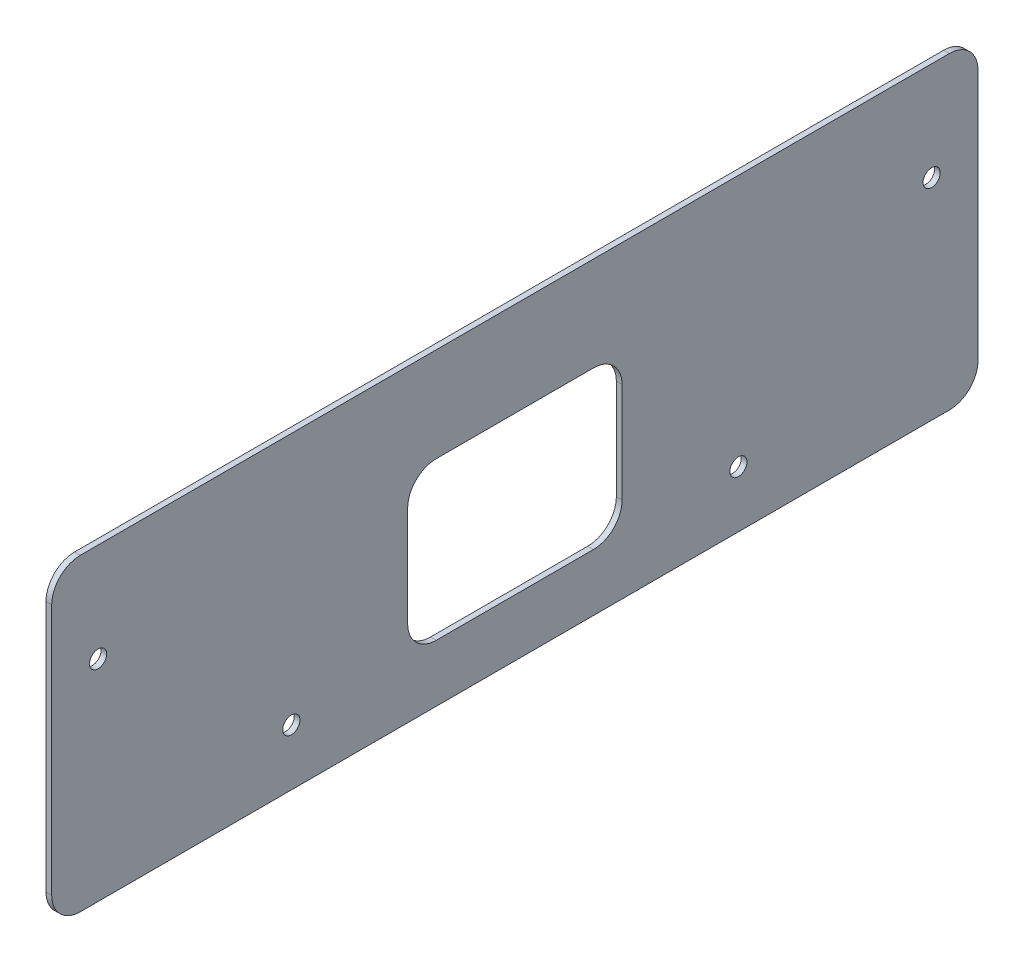
ISO-10303-21;
HEADER;
FILE_DESCRIPTION(('STEP AP214'),'2;1');
FILE_NAME('part.step','',(''),(''),'','','');
FILE_SCHEMA(('AUTOMOTIVE_DESIGN { 1 0 10303 214 1 1 1 1 }'));
ENDSEC;
DATA;
#1=APPLICATION_CONTEXT('core data for automotive mechanical design processes');
#2=APPLICATION_PROTOCOL_DEFINITION('international standard','automotive_design',2000,#1);
#3=PRODUCT_CONTEXT('',#1,'mechanical');
#4=PRODUCT('Part','Part','',(#3));
#5=PRODUCT_RELATED_PRODUCT_CATEGORY('part','',(#4));
#6=PRODUCT_DEFINITION_FORMATION('','',#4);
#7=PRODUCT_DEFINITION_CONTEXT('part definition',#1,'design');
#8=PRODUCT_DEFINITION('design','',#6,#7);
#9=PRODUCT_DEFINITION_SHAPE('','',#8);
#10=(LENGTH_UNIT() NAMED_UNIT(*) SI_UNIT(.MILLI.,.METRE.));
#11=(NAMED_UNIT(*) PLANE_ANGLE_UNIT() SI_UNIT($,.RADIAN.));
#12=(NAMED_UNIT(*) SI_UNIT($,.STERADIAN.) SOLID_ANGLE_UNIT());
#13=UNCERTAINTY_MEASURE_WITH_UNIT(LENGTH_MEASURE(1.E-05),#10,'distance_accuracy_value','');
#14=(GEOMETRIC_REPRESENTATION_CONTEXT(3) GLOBAL_UNCERTAINTY_ASSIGNED_CONTEXT((#13)) GLOBAL_UNIT_ASSIGNED_CONTEXT((#10,
#11,#12)) REPRESENTATION_CONTEXT('',''));
#15=CARTESIAN_POINT('',(0.,0.,0.));
#16=DIRECTION('',(0.,0.,1.));
#17=DIRECTION('',(1.,0.,0.));
#18=AXIS2_PLACEMENT_3D('',#15,#16,#17);
#19=CARTESIAN_POINT('',(-2.,-54.,-162.));
#20=DIRECTION('',(0.,0.,-1.));
#21=DIRECTION('',(-1.,0.,0.));
#22=AXIS2_PLACEMENT_3D('',#19,#20,#21);
#23=PLANE('',#22);
#24=DIRECTION('',(0.,1.,0.));
#25=VECTOR('',#24,1.);
#26=CARTESIAN_POINT('',(0.,-54.,-162.));
#27=LINE('',#26,#25);
#28=CARTESIAN_POINT('',(0.,-44.,-162.));
#29=VERTEX_POINT('',#28);
#30=CARTESIAN_POINT('',(0.,44.,-162.));
#31=VERTEX_POINT('',#30);
#32=EDGE_CURVE('E223',#29,#31,#27,.T.);
#33=ORIENTED_EDGE('',*,*,#32,.F.);
#34=DIRECTION('',(1.,0.,0.));
#35=VECTOR('',#34,1.);
#36=CARTESIAN_POINT('',(-2.,-44.,-162.));
#37=LINE('',#36,#35);
#38=CARTESIAN_POINT('',(-2.,-44.,-162.));
#39=VERTEX_POINT('',#38);
#40=EDGE_CURVE('E327',#29,#39,#37,.F.);
#41=ORIENTED_EDGE('',*,*,#40,.T.);
#42=DIRECTION('',(0.,1.,0.));
#43=VECTOR('',#42,1.);
#44=CARTESIAN_POINT('',(-2.,-54.,-162.));
#45=LINE('',#44,#43);
#46=CARTESIAN_POINT('',(-2.,44.,-162.));
#47=VERTEX_POINT('',#46);
#48=EDGE_CURVE('E235',#39,#47,#45,.T.);
#49=ORIENTED_EDGE('',*,*,#48,.T.);
#50=DIRECTION('',(1.,0.,0.));
#51=VECTOR('',#50,1.);
#52=CARTESIAN_POINT('',(-2.,44.,-162.));
#53=LINE('',#52,#51);
#54=EDGE_CURVE('E323',#47,#31,#53,.T.);
#55=ORIENTED_EDGE('',*,*,#54,.T.);
#56=EDGE_LOOP('',(#33,#41,#49,#55));
#57=FACE_BOUND('',#56,.T.);
#58=ADVANCED_FACE('F42',(#57),#23,.T.);
#59=CARTESIAN_POINT('',(-2.,-54.,162.));
#60=DIRECTION('',(0.,-1.,0.));
#61=DIRECTION('',(0.,0.,-1.));
#62=AXIS2_PLACEMENT_3D('',#59,#60,#61);
#63=PLANE('',#62);
#64=DIRECTION('',(0.,0.,-1.));
#65=VECTOR('',#64,1.);
#66=CARTESIAN_POINT('',(-2.,-54.,162.));
#67=LINE('',#66,#65);
#68=CARTESIAN_POINT('',(-2.00000000000033,-54.,152.));
#69=VERTEX_POINT('',#68);
#70=CARTESIAN_POINT('',(-2.,-54.,-152.));
#71=VERTEX_POINT('',#70);
#72=EDGE_CURVE('E247',#69,#71,#67,.T.);
#73=ORIENTED_EDGE('',*,*,#72,.T.);
#74=DIRECTION('',(1.,0.,0.));
#75=VECTOR('',#74,1.);
#76=CARTESIAN_POINT('',(-2.,-54.,-152.));
#77=LINE('',#76,#75);
#78=CARTESIAN_POINT('',(0.,-54.,-152.));
#79=VERTEX_POINT('',#78);
#80=EDGE_CURVE('E307',#71,#79,#77,.T.);
#81=ORIENTED_EDGE('',*,*,#80,.T.);
#82=DIRECTION('',(0.,0.,-1.));
#83=VECTOR('',#82,1.);
#84=CARTESIAN_POINT('',(0.,-54.,162.));
#85=LINE('',#84,#83);
#86=CARTESIAN_POINT('',(-3.33066907387547E-13,-54.,152.));
#87=VERTEX_POINT('',#86);
#88=EDGE_CURVE('E240',#87,#79,#85,.T.);
#89=ORIENTED_EDGE('',*,*,#88,.F.);
#90=DIRECTION('',(1.,0.,0.));
#91=VECTOR('',#90,1.);
#92=CARTESIAN_POINT('',(-2.00000000000033,-54.,152.));
#93=LINE('',#92,#91);
#94=EDGE_CURVE('E304',#87,#69,#93,.F.);
#95=ORIENTED_EDGE('',*,*,#94,.T.);
#96=EDGE_LOOP('',(#73,#81,#89,#95));
#97=FACE_BOUND('',#96,.T.);
#98=ADVANCED_FACE('F375',(#97),#63,.T.);
#99=CARTESIAN_POINT('',(-2.,-54.,162.));
#100=DIRECTION('',(0.,0.,1.));
#101=DIRECTION('',(1.,0.,0.));
#102=AXIS2_PLACEMENT_3D('',#99,#100,#101);
#103=PLANE('',#102);
#104=DIRECTION('',(0.,-1.,0.));
#105=VECTOR('',#104,1.);
#106=CARTESIAN_POINT('',(-2.,-54.,162.));
#107=LINE('',#106,#105);
#108=CARTESIAN_POINT('',(-2.,44.,162.));
#109=VERTEX_POINT('',#108);
#110=CARTESIAN_POINT('',(-2.,-44.,162.));
#111=VERTEX_POINT('',#110);
#112=EDGE_CURVE('E243',#109,#111,#107,.T.);
#113=ORIENTED_EDGE('',*,*,#112,.T.);
#114=DIRECTION('',(1.,0.,0.));
#115=VECTOR('',#114,1.);
#116=CARTESIAN_POINT('',(-2.,-44.,162.));
#117=LINE('',#116,#115);
#118=CARTESIAN_POINT('',(0.,-44.,162.));
#119=VERTEX_POINT('',#118);
#120=EDGE_CURVE('E11',#111,#119,#117,.T.);
#121=ORIENTED_EDGE('',*,*,#120,.T.);
#122=DIRECTION('',(0.,-1.,0.));
#123=VECTOR('',#122,1.);
#124=CARTESIAN_POINT('',(0.,-54.,162.));
#125=LINE('',#124,#123);
#126=CARTESIAN_POINT('',(0.,44.,162.));
#127=VERTEX_POINT('',#126);
#128=EDGE_CURVE('E258',#127,#119,#125,.T.);
#129=ORIENTED_EDGE('',*,*,#128,.F.);
#130=DIRECTION('',(1.,0.,0.));
#131=VECTOR('',#130,1.);
#132=CARTESIAN_POINT('',(-2.,44.,162.));
#133=LINE('',#132,#131);
#134=EDGE_CURVE('E51',#127,#109,#133,.F.);
#135=ORIENTED_EDGE('',*,*,#134,.T.);
#136=EDGE_LOOP('',(#113,#121,#129,#135));
#137=FACE_BOUND('',#136,.T.);
#138=ADVANCED_FACE('F352',(#137),#103,.T.);
#139=CARTESIAN_POINT('',(-2.,54.,162.));
#140=DIRECTION('',(0.,1.,0.));
#141=DIRECTION('',(0.,0.,1.));
#142=AXIS2_PLACEMENT_3D('',#139,#140,#141);
#143=PLANE('',#142);
#144=DIRECTION('',(0.,0.,1.));
#145=VECTOR('',#144,1.);
#146=CARTESIAN_POINT('',(0.,54.,162.));
#147=LINE('',#146,#145);
#148=CARTESIAN_POINT('',(0.,54.,-152.));
#149=VERTEX_POINT('',#148);
#150=CARTESIAN_POINT('',(-3.33066907387547E-13,54.,152.));
#151=VERTEX_POINT('',#150);
#152=EDGE_CURVE('E254',#149,#151,#147,.T.);
#153=ORIENTED_EDGE('',*,*,#152,.F.);
#154=DIRECTION('',(1.,0.,0.));
#155=VECTOR('',#154,1.);
#156=CARTESIAN_POINT('',(-2.,54.,-152.));
#157=LINE('',#156,#155);
#158=CARTESIAN_POINT('',(-2.,54.,-152.));
#159=VERTEX_POINT('',#158);
#160=EDGE_CURVE('E65',#149,#159,#157,.F.);
#161=ORIENTED_EDGE('',*,*,#160,.T.);
#162=DIRECTION('',(0.,0.,1.));
#163=VECTOR('',#162,1.);
#164=CARTESIAN_POINT('',(-2.,54.,162.));
#165=LINE('',#164,#163);
#166=CARTESIAN_POINT('',(-2.00000000000033,54.,152.));
#167=VERTEX_POINT('',#166);
#168=EDGE_CURVE('E239',#159,#167,#165,.T.);
#169=ORIENTED_EDGE('',*,*,#168,.T.);
#170=DIRECTION('',(1.,0.,0.));
#171=VECTOR('',#170,1.);
#172=CARTESIAN_POINT('',(-2.00000000000033,54.,152.));
#173=LINE('',#172,#171);
#174=EDGE_CURVE('E341',#167,#151,#173,.T.);
#175=ORIENTED_EDGE('',*,*,#174,.T.);
#176=EDGE_LOOP('',(#153,#161,#169,#175));
#177=FACE_BOUND('',#176,.T.);
#178=ADVANCED_FACE('F360',(#177),#143,.T.);
#179=CARTESIAN_POINT('',(-2.,0.,0.));
#180=DIRECTION('',(-1.,0.,0.));
#181=DIRECTION('',(0.,0.,1.));
#182=AXIS2_PLACEMENT_3D('',#179,#180,#181);
#183=PLANE('',#182);
#184=DIRECTION('',(0.,0.,-1.));
#185=VECTOR('',#184,1.);
#186=CARTESIAN_POINT('',(-2.,-34.,37.5));
#187=LINE('',#186,#185);
#188=CARTESIAN_POINT('',(-2.,-34.,27.5));
#189=VERTEX_POINT('',#188);
#190=CARTESIAN_POINT('',(-2.,-34.,-27.5));
#191=VERTEX_POINT('',#190);
#192=EDGE_CURVE('E179',#189,#191,#187,.T.);
#193=ORIENTED_EDGE('',*,*,#192,.T.);
#194=CARTESIAN_POINT('',(-2.,-24.,-27.5));
#195=DIRECTION('',(-1.,0.,0.));
#196=DIRECTION('',(0.,0.,1.));
#197=AXIS2_PLACEMENT_3D('',#194,#195,#196);
#198=CIRCLE('',#197,10.);
#199=CARTESIAN_POINT('',(-2.00000000000033,-24.,-37.5));
#200=VERTEX_POINT('',#199);
#201=EDGE_CURVE('E289',#191,#200,#198,.F.);
#202=ORIENTED_EDGE('',*,*,#201,.T.);
#203=DIRECTION('',(0.,1.,0.));
#204=VECTOR('',#203,1.);
#205=CARTESIAN_POINT('',(-2.00000000000033,-34.,-37.5));
#206=LINE('',#205,#204);
#207=CARTESIAN_POINT('',(-2.00000000000033,11.,-37.5));
#208=VERTEX_POINT('',#207);
#209=EDGE_CURVE('E653',#200,#208,#206,.T.);
#210=ORIENTED_EDGE('',*,*,#209,.T.);
#211=CARTESIAN_POINT('',(-2.,11.,-27.5));
#212=DIRECTION('',(-1.,0.,0.));
#213=DIRECTION('',(0.,0.,1.));
#214=AXIS2_PLACEMENT_3D('',#211,#212,#213);
#215=CIRCLE('',#214,10.);
#216=CARTESIAN_POINT('',(-2.,21.,-27.5));
#217=VERTEX_POINT('',#216);
#218=EDGE_CURVE('E295',#208,#217,#215,.F.);
#219=ORIENTED_EDGE('',*,*,#218,.T.);
#220=DIRECTION('',(0.,0.,1.));
#221=VECTOR('',#220,1.);
#222=CARTESIAN_POINT('',(-2.,21.,37.5));
#223=LINE('',#222,#221);
#224=CARTESIAN_POINT('',(-2.,21.,27.5));
#225=VERTEX_POINT('',#224);
#226=EDGE_CURVE('E190',#217,#225,#223,.T.);
#227=ORIENTED_EDGE('',*,*,#226,.T.);
#228=CARTESIAN_POINT('',(-2.,11.,27.5));
#229=DIRECTION('',(-1.,0.,0.));
#230=DIRECTION('',(0.,0.,1.));
#231=AXIS2_PLACEMENT_3D('',#228,#229,#230);
#232=CIRCLE('',#231,10.);
#233=CARTESIAN_POINT('',(-2.,11.,37.5));
#234=VERTEX_POINT('',#233);
#235=EDGE_CURVE('E301',#225,#234,#232,.F.);
#236=ORIENTED_EDGE('',*,*,#235,.T.);
#237=DIRECTION('',(0.,-1.,0.));
#238=VECTOR('',#237,1.);
#239=CARTESIAN_POINT('',(-2.,-34.,37.5));
#240=LINE('',#239,#238);
#241=CARTESIAN_POINT('',(-2.,-24.,37.5));
#242=VERTEX_POINT('',#241);
#243=EDGE_CURVE('E654',#234,#242,#240,.T.);
#244=ORIENTED_EDGE('',*,*,#243,.T.);
#245=CARTESIAN_POINT('',(-2.,-24.,27.5));
#246=DIRECTION('',(-1.,0.,0.));
#247=DIRECTION('',(0.,0.,1.));
#248=AXIS2_PLACEMENT_3D('',#245,#246,#247);
#249=CIRCLE('',#248,10.);
#250=EDGE_CURVE('E169',#242,#189,#249,.F.);
#251=ORIENTED_EDGE('',*,*,#250,.T.);
#252=EDGE_LOOP('',(#193,#202,#210,#219,#227,#236,#244,#251));
#253=FACE_BOUND('',#252,.T.);
#254=CARTESIAN_POINT('',(-2.,19.5000000000001,-145.781989417244));
#255=DIRECTION('',(-1.,0.,0.));
#256=DIRECTION('',(0.,0.,1.));
#257=AXIS2_PLACEMENT_3D('',#254,#255,#256);
#258=CIRCLE('',#257,2.99999999999999);
#259=CARTESIAN_POINT('',(-2.,19.5000000000001,-142.781989417244));
#260=VERTEX_POINT('',#259);
#261=EDGE_CURVE('E207',#260,#260,#258,.T.);
#262=ORIENTED_EDGE('',*,*,#261,.F.);
#263=EDGE_LOOP('',(#262));
#264=FACE_BOUND('',#263,.T.);
#265=CARTESIAN_POINT('',(-2.,-34.2695676665339,-78.1843784220301));
#266=DIRECTION('',(-1.,0.,0.));
#267=DIRECTION('',(0.,0.,1.));
#268=AXIS2_PLACEMENT_3D('',#265,#266,#267);
#269=CIRCLE('',#268,3.00000000000001);
#270=CARTESIAN_POINT('',(-2.,-34.2695676665339,-75.1843784220301));
#271=VERTEX_POINT('',#270);
#272=EDGE_CURVE('E208',#271,#271,#269,.T.);
#273=ORIENTED_EDGE('',*,*,#272,.F.);
#274=EDGE_LOOP('',(#273));
#275=FACE_BOUND('',#274,.T.);
#276=CARTESIAN_POINT('',(-2.,19.5000000000001,145.781989417244));
#277=DIRECTION('',(-1.,0.,0.));
#278=DIRECTION('',(0.,0.,1.));
#279=AXIS2_PLACEMENT_3D('',#276,#277,#278);
#280=CIRCLE('',#279,2.99999999999999);
#281=CARTESIAN_POINT('',(-2.,19.5000000000001,148.781989417244));
#282=VERTEX_POINT('',#281);
#283=EDGE_CURVE('E224',#282,#282,#280,.F.);
#284=ORIENTED_EDGE('',*,*,#283,.T.);
#285=EDGE_LOOP('',(#284));
#286=FACE_BOUND('',#285,.T.);
#287=CARTESIAN_POINT('',(-2.,-34.2695676665339,78.1843784220301));
#288=DIRECTION('',(-1.,0.,0.));
#289=DIRECTION('',(0.,0.,1.));
#290=AXIS2_PLACEMENT_3D('',#287,#288,#289);
#291=CIRCLE('',#290,3.00000000000001);
#292=CARTESIAN_POINT('',(-2.,-34.2695676665339,81.1843784220301));
#293=VERTEX_POINT('',#292);
#294=EDGE_CURVE('E212',#293,#293,#291,.F.);
#295=ORIENTED_EDGE('',*,*,#294,.T.);
#296=EDGE_LOOP('',(#295));
#297=FACE_BOUND('',#296,.T.);
#298=ORIENTED_EDGE('',*,*,#48,.F.);
#299=CARTESIAN_POINT('',(-2.,-44.,-152.));
#300=DIRECTION('',(-1.,0.,0.));
#301=DIRECTION('',(0.,0.,1.));
#302=AXIS2_PLACEMENT_3D('',#299,#300,#301);
#303=CIRCLE('',#302,10.);
#304=EDGE_CURVE('E338',#39,#71,#303,.T.);
#305=ORIENTED_EDGE('',*,*,#304,.T.);
#306=ORIENTED_EDGE('',*,*,#72,.F.);
#307=CARTESIAN_POINT('',(-2.00000000000033,-44.,152.));
#308=DIRECTION('',(-1.,0.,0.));
#309=DIRECTION('',(0.,0.,1.));
#310=AXIS2_PLACEMENT_3D('',#307,#308,#309);
#311=CIRCLE('',#310,10.);
#312=EDGE_CURVE('E332',#69,#111,#311,.T.);
#313=ORIENTED_EDGE('',*,*,#312,.T.);
#314=ORIENTED_EDGE('',*,*,#112,.F.);
#315=CARTESIAN_POINT('',(-2.00000000000033,44.,152.));
#316=DIRECTION('',(-1.,0.,0.));
#317=DIRECTION('',(0.,0.,1.));
#318=AXIS2_PLACEMENT_3D('',#315,#316,#317);
#319=CIRCLE('',#318,10.);
#320=EDGE_CURVE('E58',#109,#167,#319,.T.);
#321=ORIENTED_EDGE('',*,*,#320,.T.);
#322=ORIENTED_EDGE('',*,*,#168,.F.);
#323=CARTESIAN_POINT('',(-2.,44.,-152.));
#324=DIRECTION('',(-1.,0.,0.));
#325=DIRECTION('',(0.,0.,1.));
#326=AXIS2_PLACEMENT_3D('',#323,#324,#325);
#327=CIRCLE('',#326,10.);
#328=EDGE_CURVE('E335',#159,#47,#327,.T.);
#329=ORIENTED_EDGE('',*,*,#328,.T.);
#330=EDGE_LOOP('',(#298,#305,#306,#313,#314,#321,#322,#329));
#331=FACE_BOUND('',#330,.T.);
#332=ADVANCED_FACE('F356',(#253,#264,#275,#286,#297,#331),#183,.T.);
#333=CARTESIAN_POINT('',(0.,0.,0.));
#334=DIRECTION('',(-1.,0.,0.));
#335=DIRECTION('',(0.,0.,1.));
#336=AXIS2_PLACEMENT_3D('',#333,#334,#335);
#337=PLANE('',#336);
#338=DIRECTION('',(0.,0.,1.));
#339=VECTOR('',#338,1.);
#340=CARTESIAN_POINT('',(0.,21.,37.5));
#341=LINE('',#340,#339);
#342=CARTESIAN_POINT('',(0.,21.,-27.5));
#343=VERTEX_POINT('',#342);
#344=CARTESIAN_POINT('',(0.,21.,27.5));
#345=VERTEX_POINT('',#344);
#346=EDGE_CURVE('E199',#343,#345,#341,.T.);
#347=ORIENTED_EDGE('',*,*,#346,.F.);
#348=CARTESIAN_POINT('',(0.,11.,-27.5));
#349=DIRECTION('',(-1.,0.,0.));
#350=DIRECTION('',(0.,0.,1.));
#351=AXIS2_PLACEMENT_3D('',#348,#349,#350);
#352=CIRCLE('',#351,10.);
#353=CARTESIAN_POINT('',(-3.33066907387547E-13,11.,-37.5));
#354=VERTEX_POINT('',#353);
#355=EDGE_CURVE('E292',#343,#354,#352,.T.);
#356=ORIENTED_EDGE('',*,*,#355,.T.);
#357=DIRECTION('',(0.,1.,0.));
#358=VECTOR('',#357,1.);
#359=CARTESIAN_POINT('',(-3.33066907387547E-13,-34.,-37.5));
#360=LINE('',#359,#358);
#361=CARTESIAN_POINT('',(-3.33066907387547E-13,-24.,-37.5));
#362=VERTEX_POINT('',#361);
#363=EDGE_CURVE('E658',#362,#354,#360,.T.);
#364=ORIENTED_EDGE('',*,*,#363,.F.);
#365=CARTESIAN_POINT('',(0.,-24.,-27.5));
#366=DIRECTION('',(-1.,0.,0.));
#367=DIRECTION('',(0.,0.,1.));
#368=AXIS2_PLACEMENT_3D('',#365,#366,#367);
#369=CIRCLE('',#368,10.);
#370=CARTESIAN_POINT('',(0.,-34.,-27.5));
#371=VERTEX_POINT('',#370);
#372=EDGE_CURVE('E188',#362,#371,#369,.T.);
#373=ORIENTED_EDGE('',*,*,#372,.T.);
#374=DIRECTION('',(0.,0.,-1.));
#375=VECTOR('',#374,1.);
#376=CARTESIAN_POINT('',(0.,-34.,37.5));
#377=LINE('',#376,#375);
#378=CARTESIAN_POINT('',(0.,-34.,27.5));
#379=VERTEX_POINT('',#378);
#380=EDGE_CURVE('E176',#379,#371,#377,.T.);
#381=ORIENTED_EDGE('',*,*,#380,.F.);
#382=CARTESIAN_POINT('',(0.,-24.,27.5));
#383=DIRECTION('',(-1.,0.,0.));
#384=DIRECTION('',(0.,0.,1.));
#385=AXIS2_PLACEMENT_3D('',#382,#383,#384);
#386=CIRCLE('',#385,10.);
#387=CARTESIAN_POINT('',(0.,-24.,37.5));
#388=VERTEX_POINT('',#387);
#389=EDGE_CURVE('E158',#379,#388,#386,.T.);
#390=ORIENTED_EDGE('',*,*,#389,.T.);
#391=DIRECTION('',(0.,-1.,0.));
#392=VECTOR('',#391,1.);
#393=CARTESIAN_POINT('',(0.,-34.,37.5));
#394=LINE('',#393,#392);
#395=CARTESIAN_POINT('',(0.,11.,37.5));
#396=VERTEX_POINT('',#395);
#397=EDGE_CURVE('E191',#396,#388,#394,.T.);
#398=ORIENTED_EDGE('',*,*,#397,.F.);
#399=CARTESIAN_POINT('',(0.,11.,27.5));
#400=DIRECTION('',(-1.,0.,0.));
#401=DIRECTION('',(0.,0.,1.));
#402=AXIS2_PLACEMENT_3D('',#399,#400,#401);
#403=CIRCLE('',#402,10.);
#404=EDGE_CURVE('E298',#396,#345,#403,.T.);
#405=ORIENTED_EDGE('',*,*,#404,.T.);
#406=EDGE_LOOP('',(#347,#356,#364,#373,#381,#390,#398,#405));
#407=FACE_BOUND('',#406,.T.);
#408=CARTESIAN_POINT('',(0.,19.5000000000001,-145.781989417244));
#409=DIRECTION('',(-1.,0.,0.));
#410=DIRECTION('',(0.,0.,1.));
#411=AXIS2_PLACEMENT_3D('',#408,#409,#410);
#412=CIRCLE('',#411,2.99999999999999);
#413=CARTESIAN_POINT('',(0.,19.5000000000001,-142.781989417244));
#414=VERTEX_POINT('',#413);
#415=EDGE_CURVE('E203',#414,#414,#412,.T.);
#416=ORIENTED_EDGE('',*,*,#415,.T.);
#417=EDGE_LOOP('',(#416));
#418=FACE_BOUND('',#417,.T.);
#419=CARTESIAN_POINT('',(0.,-34.2695676665339,-78.1843784220301));
#420=DIRECTION('',(-1.,0.,0.));
#421=DIRECTION('',(0.,0.,1.));
#422=AXIS2_PLACEMENT_3D('',#419,#420,#421);
#423=CIRCLE('',#422,3.00000000000001);
#424=CARTESIAN_POINT('',(0.,-34.2695676665339,-75.1843784220301));
#425=VERTEX_POINT('',#424);
#426=EDGE_CURVE('E196',#425,#425,#423,.T.);
#427=ORIENTED_EDGE('',*,*,#426,.T.);
#428=EDGE_LOOP('',(#427));
#429=FACE_BOUND('',#428,.T.);
#430=CARTESIAN_POINT('',(0.,19.5000000000001,145.781989417244));
#431=DIRECTION('',(1.,0.,0.));
#432=DIRECTION('',(0.,0.,-1.));
#433=AXIS2_PLACEMENT_3D('',#430,#431,#432);
#434=CIRCLE('',#433,2.99999999999999);
#435=CARTESIAN_POINT('',(0.,19.5000000000001,142.781989417244));
#436=VERTEX_POINT('',#435);
#437=EDGE_CURVE('E219',#436,#436,#434,.T.);
#438=ORIENTED_EDGE('',*,*,#437,.F.);
#439=EDGE_LOOP('',(#438));
#440=FACE_BOUND('',#439,.T.);
#441=CARTESIAN_POINT('',(0.,-34.2695676665339,78.1843784220301));
#442=DIRECTION('',(1.,0.,0.));
#443=DIRECTION('',(0.,0.,-1.));
#444=AXIS2_PLACEMENT_3D('',#441,#442,#443);
#445=CIRCLE('',#444,3.00000000000001);
#446=CARTESIAN_POINT('',(0.,-34.2695676665339,75.1843784220301));
#447=VERTEX_POINT('',#446);
#448=EDGE_CURVE('E228',#447,#447,#445,.T.);
#449=ORIENTED_EDGE('',*,*,#448,.F.);
#450=EDGE_LOOP('',(#449));
#451=FACE_BOUND('',#450,.T.);
#452=ORIENTED_EDGE('',*,*,#88,.T.);
#453=CARTESIAN_POINT('',(0.,-44.,-152.));
#454=DIRECTION('',(-1.,0.,0.));
#455=DIRECTION('',(0.,0.,1.));
#456=AXIS2_PLACEMENT_3D('',#453,#454,#455);
#457=CIRCLE('',#456,10.);
#458=EDGE_CURVE('E320',#79,#29,#457,.F.);
#459=ORIENTED_EDGE('',*,*,#458,.T.);
#460=ORIENTED_EDGE('',*,*,#32,.T.);
#461=CARTESIAN_POINT('',(0.,44.,-152.));
#462=DIRECTION('',(-1.,0.,0.));
#463=DIRECTION('',(0.,0.,1.));
#464=AXIS2_PLACEMENT_3D('',#461,#462,#463);
#465=CIRCLE('',#464,10.);
#466=EDGE_CURVE('E317',#31,#149,#465,.F.);
#467=ORIENTED_EDGE('',*,*,#466,.T.);
#468=ORIENTED_EDGE('',*,*,#152,.T.);
#469=CARTESIAN_POINT('',(-3.33066907387547E-13,44.,152.));
#470=DIRECTION('',(-1.,0.,0.));
#471=DIRECTION('',(0.,0.,1.));
#472=AXIS2_PLACEMENT_3D('',#469,#470,#471);
#473=CIRCLE('',#472,10.);
#474=EDGE_CURVE('E311',#151,#127,#473,.F.);
#475=ORIENTED_EDGE('',*,*,#474,.T.);
#476=ORIENTED_EDGE('',*,*,#128,.T.);
#477=CARTESIAN_POINT('',(-3.33066907387547E-13,-44.,152.));
#478=DIRECTION('',(-1.,0.,0.));
#479=DIRECTION('',(0.,0.,1.));
#480=AXIS2_PLACEMENT_3D('',#477,#478,#479);
#481=CIRCLE('',#480,10.);
#482=EDGE_CURVE('E314',#119,#87,#481,.F.);
#483=ORIENTED_EDGE('',*,*,#482,.T.);
#484=EDGE_LOOP('',(#452,#459,#460,#467,#468,#475,#476,#483));
#485=FACE_BOUND('',#484,.T.);
#486=ADVANCED_FACE('F185',(#407,#418,#429,#440,#451,#485),#337,.F.);
#487=CARTESIAN_POINT('',(-2.00099999999998,-34.2695676665339,78.1843784220301));
#488=DIRECTION('',(1.,0.,0.));
#489=DIRECTION('',(0.,0.,-1.));
#490=AXIS2_PLACEMENT_3D('',#487,#488,#489);
#491=CYLINDRICAL_SURFACE('',#490,3.00000000000001);
#492=ORIENTED_EDGE('',*,*,#294,.F.);
#493=EDGE_LOOP('',(#492));
#494=FACE_BOUND('',#493,.T.);
#495=ORIENTED_EDGE('',*,*,#448,.T.);
#496=EDGE_LOOP('',(#495));
#497=FACE_BOUND('',#496,.T.);
#498=ADVANCED_FACE('F545',(#494,#497),#491,.F.);
#499=CARTESIAN_POINT('',(-2.00099999999998,19.5000000000001,145.781989417244));
#500=DIRECTION('',(1.,0.,0.));
#501=DIRECTION('',(0.,0.,-1.));
#502=AXIS2_PLACEMENT_3D('',#499,#500,#501);
#503=CYLINDRICAL_SURFACE('',#502,2.99999999999999);
#504=ORIENTED_EDGE('',*,*,#283,.F.);
#505=EDGE_LOOP('',(#504));
#506=FACE_BOUND('',#505,.T.);
#507=ORIENTED_EDGE('',*,*,#437,.T.);
#508=EDGE_LOOP('',(#507));
#509=FACE_BOUND('',#508,.T.);
#510=ADVANCED_FACE('F535',(#506,#509),#503,.F.);
#511=CARTESIAN_POINT('',(-2.00099999999998,-34.2695676665339,-78.1843784220301));
#512=DIRECTION('',(1.,0.,0.));
#513=DIRECTION('',(0.,0.,-1.));
#514=AXIS2_PLACEMENT_3D('',#511,#512,#513);
#515=CYLINDRICAL_SURFACE('',#514,3.00000000000001);
#516=ORIENTED_EDGE('',*,*,#272,.T.);
#517=EDGE_LOOP('',(#516));
#518=FACE_BOUND('',#517,.T.);
#519=ORIENTED_EDGE('',*,*,#426,.F.);
#520=EDGE_LOOP('',(#519));
#521=FACE_BOUND('',#520,.T.);
#522=ADVANCED_FACE('F525',(#518,#521),#515,.F.);
#523=CARTESIAN_POINT('',(-2.00099999999998,19.5000000000001,-145.781989417244));
#524=DIRECTION('',(1.,0.,0.));
#525=DIRECTION('',(0.,0.,-1.));
#526=AXIS2_PLACEMENT_3D('',#523,#524,#525);
#527=CYLINDRICAL_SURFACE('',#526,2.99999999999999);
#528=ORIENTED_EDGE('',*,*,#261,.T.);
#529=EDGE_LOOP('',(#528));
#530=FACE_BOUND('',#529,.T.);
#531=ORIENTED_EDGE('',*,*,#415,.F.);
#532=EDGE_LOOP('',(#531));
#533=FACE_BOUND('',#532,.T.);
#534=ADVANCED_FACE('F515',(#530,#533),#527,.F.);
#535=CARTESIAN_POINT('',(-2.00100000000031,-34.,-37.5));
#536=DIRECTION('',(0.,0.,-1.));
#537=DIRECTION('',(-1.,0.,0.));
#538=AXIS2_PLACEMENT_3D('',#535,#536,#537);
#539=PLANE('',#538);
#540=ORIENTED_EDGE('',*,*,#209,.F.);
#541=DIRECTION('',(1.,0.,0.));
#542=VECTOR('',#541,1.);
#543=CARTESIAN_POINT('',(-3.33066907387547E-13,-24.,-37.5));
#544=LINE('',#543,#542);
#545=EDGE_CURVE('E275',#200,#362,#544,.T.);
#546=ORIENTED_EDGE('',*,*,#545,.T.);
#547=ORIENTED_EDGE('',*,*,#363,.T.);
#548=DIRECTION('',(1.,0.,0.));
#549=VECTOR('',#548,1.);
#550=CARTESIAN_POINT('',(-2.00000000000033,11.,-37.5));
#551=LINE('',#550,#549);
#552=EDGE_CURVE('E272',#354,#208,#551,.F.);
#553=ORIENTED_EDGE('',*,*,#552,.T.);
#554=EDGE_LOOP('',(#540,#546,#547,#553));
#555=FACE_BOUND('',#554,.T.);
#556=ADVANCED_FACE('F506',(#555),#539,.F.);
#557=CARTESIAN_POINT('',(-2.00099999999998,-34.,37.5));
#558=DIRECTION('',(0.,-1.,0.));
#559=DIRECTION('',(0.,0.,-1.));
#560=AXIS2_PLACEMENT_3D('',#557,#558,#559);
#561=PLANE('',#560);
#562=ORIENTED_EDGE('',*,*,#192,.F.);
#563=DIRECTION('',(1.,0.,0.));
#564=VECTOR('',#563,1.);
#565=CARTESIAN_POINT('',(0.,-34.,27.5));
#566=LINE('',#565,#564);
#567=EDGE_CURVE('E162',#189,#379,#566,.T.);
#568=ORIENTED_EDGE('',*,*,#567,.T.);
#569=ORIENTED_EDGE('',*,*,#380,.T.);
#570=DIRECTION('',(1.,0.,0.));
#571=VECTOR('',#570,1.);
#572=CARTESIAN_POINT('',(-2.,-34.,-27.5));
#573=LINE('',#572,#571);
#574=EDGE_CURVE('E182',#371,#191,#573,.F.);
#575=ORIENTED_EDGE('',*,*,#574,.T.);
#576=EDGE_LOOP('',(#562,#568,#569,#575));
#577=FACE_BOUND('',#576,.T.);
#578=ADVANCED_FACE('F175',(#577),#561,.F.);
#579=CARTESIAN_POINT('',(-2.00099999999998,-34.,37.5));
#580=DIRECTION('',(0.,0.,1.));
#581=DIRECTION('',(1.,0.,0.));
#582=AXIS2_PLACEMENT_3D('',#579,#580,#581);
#583=PLANE('',#582);
#584=ORIENTED_EDGE('',*,*,#397,.T.);
#585=DIRECTION('',(1.,0.,0.));
#586=VECTOR('',#585,1.);
#587=CARTESIAN_POINT('',(-2.,-24.,37.5));
#588=LINE('',#587,#586);
#589=EDGE_CURVE('E163',#388,#242,#588,.F.);
#590=ORIENTED_EDGE('',*,*,#589,.T.);
#591=ORIENTED_EDGE('',*,*,#243,.F.);
#592=DIRECTION('',(1.,0.,0.));
#593=VECTOR('',#592,1.);
#594=CARTESIAN_POINT('',(0.,11.,37.5));
#595=LINE('',#594,#593);
#596=EDGE_CURVE('E181',#234,#396,#595,.T.);
#597=ORIENTED_EDGE('',*,*,#596,.T.);
#598=EDGE_LOOP('',(#584,#590,#591,#597));
#599=FACE_BOUND('',#598,.T.);
#600=ADVANCED_FACE('F487',(#599),#583,.F.);
#601=CARTESIAN_POINT('',(-2.00099999999998,21.,37.5));
#602=DIRECTION('',(0.,1.,0.));
#603=DIRECTION('',(0.,0.,1.));
#604=AXIS2_PLACEMENT_3D('',#601,#602,#603);
#605=PLANE('',#604);
#606=ORIENTED_EDGE('',*,*,#226,.F.);
#607=DIRECTION('',(1.,0.,0.));
#608=VECTOR('',#607,1.);
#609=CARTESIAN_POINT('',(0.,21.,-27.5));
#610=LINE('',#609,#608);
#611=EDGE_CURVE('E170',#217,#343,#610,.T.);
#612=ORIENTED_EDGE('',*,*,#611,.T.);
#613=ORIENTED_EDGE('',*,*,#346,.T.);
#614=DIRECTION('',(1.,0.,0.));
#615=VECTOR('',#614,1.);
#616=CARTESIAN_POINT('',(-2.,21.,27.5));
#617=LINE('',#616,#615);
#618=EDGE_CURVE('E279',#345,#225,#617,.F.);
#619=ORIENTED_EDGE('',*,*,#618,.T.);
#620=EDGE_LOOP('',(#606,#612,#613,#619));
#621=FACE_BOUND('',#620,.T.);
#622=ADVANCED_FACE('F397',(#621),#605,.F.);
#623=CARTESIAN_POINT('',(-2.00099999999998,-24.,27.5));
#624=DIRECTION('',(-1.,0.,0.));
#625=DIRECTION('',(0.,0.,1.));
#626=AXIS2_PLACEMENT_3D('',#623,#624,#625);
#627=CYLINDRICAL_SURFACE('',#626,10.);
#628=ORIENTED_EDGE('',*,*,#250,.F.);
#629=ORIENTED_EDGE('',*,*,#589,.F.);
#630=ORIENTED_EDGE('',*,*,#389,.F.);
#631=ORIENTED_EDGE('',*,*,#567,.F.);
#632=EDGE_LOOP('',(#628,#629,#630,#631));
#633=FACE_BOUND('',#632,.T.);
#634=ADVANCED_FACE('F161',(#633),#627,.F.);
#635=CARTESIAN_POINT('',(-2.00099999999998,-24.,-27.5));
#636=DIRECTION('',(-1.,0.,0.));
#637=DIRECTION('',(0.,0.,1.));
#638=AXIS2_PLACEMENT_3D('',#635,#636,#637);
#639=CYLINDRICAL_SURFACE('',#638,10.);
#640=ORIENTED_EDGE('',*,*,#201,.F.);
#641=ORIENTED_EDGE('',*,*,#574,.F.);
#642=ORIENTED_EDGE('',*,*,#372,.F.);
#643=ORIENTED_EDGE('',*,*,#545,.F.);
#644=EDGE_LOOP('',(#640,#641,#642,#643));
#645=FACE_BOUND('',#644,.T.);
#646=ADVANCED_FACE('F396',(#645),#639,.F.);
#647=CARTESIAN_POINT('',(-2.00099999999998,11.,-27.5));
#648=DIRECTION('',(-1.,0.,0.));
#649=DIRECTION('',(0.,0.,1.));
#650=AXIS2_PLACEMENT_3D('',#647,#648,#649);
#651=CYLINDRICAL_SURFACE('',#650,10.);
#652=ORIENTED_EDGE('',*,*,#218,.F.);
#653=ORIENTED_EDGE('',*,*,#552,.F.);
#654=ORIENTED_EDGE('',*,*,#355,.F.);
#655=ORIENTED_EDGE('',*,*,#611,.F.);
#656=EDGE_LOOP('',(#652,#653,#654,#655));
#657=FACE_BOUND('',#656,.T.);
#658=ADVANCED_FACE('F400',(#657),#651,.F.);
#659=CARTESIAN_POINT('',(-2.00099999999998,11.,27.5));
#660=DIRECTION('',(-1.,0.,0.));
#661=DIRECTION('',(0.,0.,1.));
#662=AXIS2_PLACEMENT_3D('',#659,#660,#661);
#663=CYLINDRICAL_SURFACE('',#662,10.);
#664=ORIENTED_EDGE('',*,*,#235,.F.);
#665=ORIENTED_EDGE('',*,*,#618,.F.);
#666=ORIENTED_EDGE('',*,*,#404,.F.);
#667=ORIENTED_EDGE('',*,*,#596,.F.);
#668=EDGE_LOOP('',(#664,#665,#666,#667));
#669=FACE_BOUND('',#668,.T.);
#670=ADVANCED_FACE('F404',(#669),#663,.F.);
#671=CARTESIAN_POINT('',(-2.,-44.,-152.));
#672=DIRECTION('',(1.,0.,0.));
#673=DIRECTION('',(0.,0.,-1.));
#674=AXIS2_PLACEMENT_3D('',#671,#672,#673);
#675=CYLINDRICAL_SURFACE('',#674,10.);
#676=ORIENTED_EDGE('',*,*,#304,.F.);
#677=ORIENTED_EDGE('',*,*,#40,.F.);
#678=ORIENTED_EDGE('',*,*,#458,.F.);
#679=ORIENTED_EDGE('',*,*,#80,.F.);
#680=EDGE_LOOP('',(#676,#677,#678,#679));
#681=FACE_BOUND('',#680,.T.);
#682=ADVANCED_FACE('F372',(#681),#675,.T.);
#683=CARTESIAN_POINT('',(-2.,44.,-152.));
#684=DIRECTION('',(1.,0.,0.));
#685=DIRECTION('',(0.,0.,-1.));
#686=AXIS2_PLACEMENT_3D('',#683,#684,#685);
#687=CYLINDRICAL_SURFACE('',#686,10.);
#688=ORIENTED_EDGE('',*,*,#328,.F.);
#689=ORIENTED_EDGE('',*,*,#160,.F.);
#690=ORIENTED_EDGE('',*,*,#466,.F.);
#691=ORIENTED_EDGE('',*,*,#54,.F.);
#692=EDGE_LOOP('',(#688,#689,#690,#691));
#693=FACE_BOUND('',#692,.T.);
#694=ADVANCED_FACE('F366',(#693),#687,.T.);
#695=CARTESIAN_POINT('',(-2.00000000000033,-44.,152.));
#696=DIRECTION('',(1.,0.,0.));
#697=DIRECTION('',(0.,0.,-1.));
#698=AXIS2_PLACEMENT_3D('',#695,#696,#697);
#699=CYLINDRICAL_SURFACE('',#698,10.);
#700=ORIENTED_EDGE('',*,*,#312,.F.);
#701=ORIENTED_EDGE('',*,*,#94,.F.);
#702=ORIENTED_EDGE('',*,*,#482,.F.);
#703=ORIENTED_EDGE('',*,*,#120,.F.);
#704=EDGE_LOOP('',(#700,#701,#702,#703));
#705=FACE_BOUND('',#704,.T.);
#706=ADVANCED_FACE('F378',(#705),#699,.T.);
#707=CARTESIAN_POINT('',(-2.00000000000033,44.,152.));
#708=DIRECTION('',(1.,0.,0.));
#709=DIRECTION('',(0.,0.,-1.));
#710=AXIS2_PLACEMENT_3D('',#707,#708,#709);
#711=CYLINDRICAL_SURFACE('',#710,10.);
#712=ORIENTED_EDGE('',*,*,#320,.F.);
#713=ORIENTED_EDGE('',*,*,#134,.F.);
#714=ORIENTED_EDGE('',*,*,#474,.F.);
#715=ORIENTED_EDGE('',*,*,#174,.F.);
#716=EDGE_LOOP('',(#712,#713,#714,#715));
#717=FACE_BOUND('',#716,.T.);
#718=ADVANCED_FACE('F44',(#717),#711,.T.);
#719=CLOSED_SHELL('',(#58,#98,#138,#178,#332,#486,#498,#510,#522,#534,#556,#578,#600,#622,#634,
#646,#658,#670,#682,#694,#706,#718));
#720=MANIFOLD_SOLID_BREP('B2',#719);
#721=ADVANCED_BREP_SHAPE_REPRESENTATION('',(#18,#720),#14);
#722=SHAPE_DEFINITION_REPRESENTATION(#9,#721);
ENDSEC;
END-ISO-10303-21;
